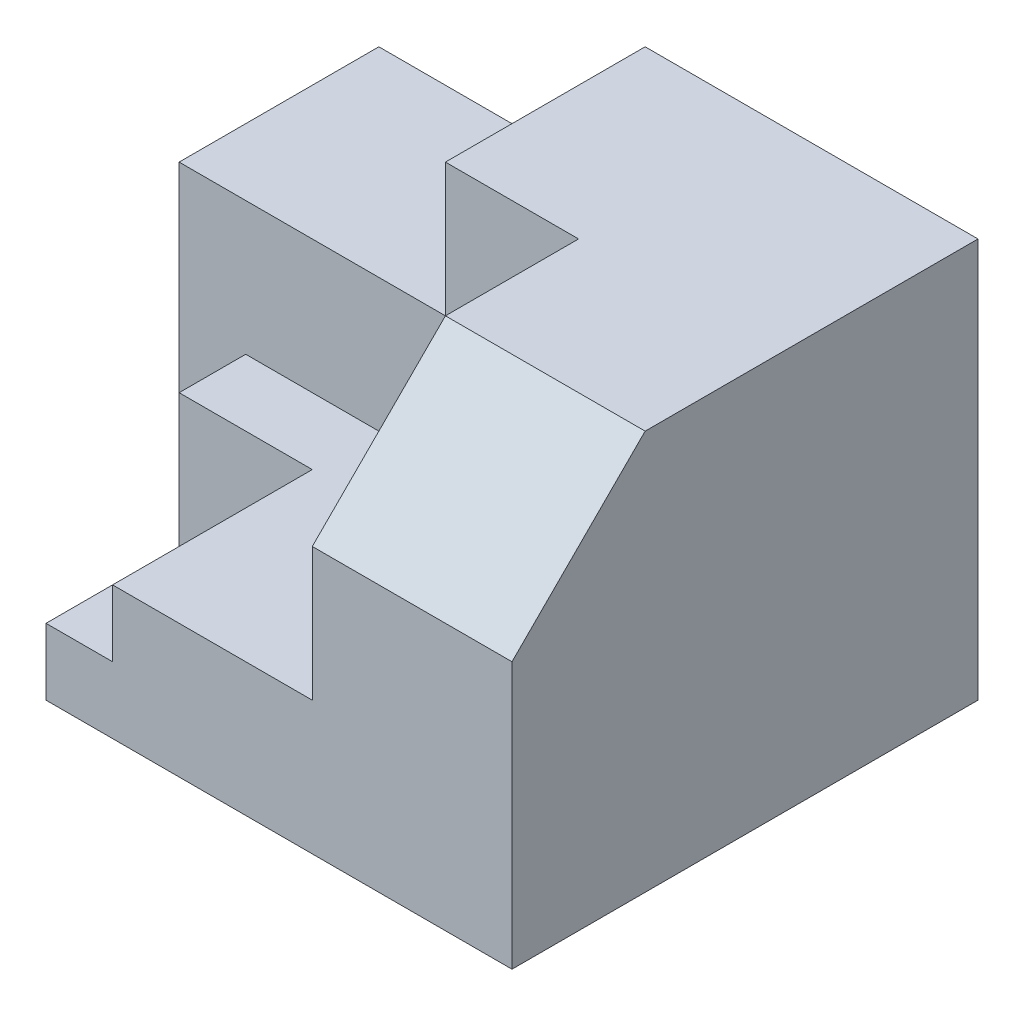
ISO-10303-21;
HEADER;
FILE_DESCRIPTION(('STEP AP214'),'2;1');
FILE_NAME('part.step','',(''),(''),'','','');
FILE_SCHEMA(('AUTOMOTIVE_DESIGN { 1 0 10303 214 1 1 1 1 }'));
ENDSEC;
DATA;
#1=APPLICATION_CONTEXT('core data for automotive mechanical design processes');
#2=APPLICATION_PROTOCOL_DEFINITION('international standard','automotive_design',2000,#1);
#3=PRODUCT_CONTEXT('',#1,'mechanical');
#4=PRODUCT('Part','Part','',(#3));
#5=PRODUCT_RELATED_PRODUCT_CATEGORY('part','',(#4));
#6=PRODUCT_DEFINITION_FORMATION('','',#4);
#7=PRODUCT_DEFINITION_CONTEXT('part definition',#1,'design');
#8=PRODUCT_DEFINITION('design','',#6,#7);
#9=PRODUCT_DEFINITION_SHAPE('','',#8);
#10=(LENGTH_UNIT() NAMED_UNIT(*) SI_UNIT(.MILLI.,.METRE.));
#11=(NAMED_UNIT(*) PLANE_ANGLE_UNIT() SI_UNIT($,.RADIAN.));
#12=(NAMED_UNIT(*) SI_UNIT($,.STERADIAN.) SOLID_ANGLE_UNIT());
#13=UNCERTAINTY_MEASURE_WITH_UNIT(LENGTH_MEASURE(1.E-05),#10,'distance_accuracy_value','');
#14=(GEOMETRIC_REPRESENTATION_CONTEXT(3) GLOBAL_UNCERTAINTY_ASSIGNED_CONTEXT((#13)) GLOBAL_UNIT_ASSIGNED_CONTEXT((#10,
#11,#12)) REPRESENTATION_CONTEXT('',''));
#15=CARTESIAN_POINT('',(0.,0.,0.));
#16=DIRECTION('',(0.,0.,1.));
#17=DIRECTION('',(1.,0.,0.));
#18=AXIS2_PLACEMENT_3D('',#15,#16,#17);
#19=CARTESIAN_POINT('',(0.,20.,0.));
#20=DIRECTION('',(0.,-1.,0.));
#21=DIRECTION('',(0.,0.,-1.));
#22=AXIS2_PLACEMENT_3D('',#19,#20,#21);
#23=PLANE('',#22);
#24=DIRECTION('',(0.,0.,-1.));
#25=VECTOR('',#24,1.);
#26=CARTESIAN_POINT('',(10.,20.,-30.));
#27=LINE('',#26,#25);
#28=CARTESIAN_POINT('',(10.,20.,-30.));
#29=VERTEX_POINT('',#28);
#30=CARTESIAN_POINT('',(10.,20.,-40.));
#31=VERTEX_POINT('',#30);
#32=EDGE_CURVE('E170',#29,#31,#27,.T.);
#33=ORIENTED_EDGE('',*,*,#32,.F.);
#34=DIRECTION('',(-1.,0.,0.));
#35=VECTOR('',#34,1.);
#36=CARTESIAN_POINT('',(0.,20.,-30.));
#37=LINE('',#36,#35);
#38=CARTESIAN_POINT('',(30.,20.,-30.));
#39=VERTEX_POINT('',#38);
#40=EDGE_CURVE('E198',#39,#29,#37,.T.);
#41=ORIENTED_EDGE('',*,*,#40,.F.);
#42=DIRECTION('',(0.,0.,-1.));
#43=VECTOR('',#42,1.);
#44=CARTESIAN_POINT('',(30.,20.,0.));
#45=LINE('',#44,#43);
#46=CARTESIAN_POINT('',(30.,20.,0.));
#47=VERTEX_POINT('',#46);
#48=EDGE_CURVE('E194',#47,#39,#45,.T.);
#49=ORIENTED_EDGE('',*,*,#48,.F.);
#50=DIRECTION('',(1.,0.,0.));
#51=VECTOR('',#50,1.);
#52=CARTESIAN_POINT('',(0.,20.,0.));
#53=LINE('',#52,#51);
#54=CARTESIAN_POINT('',(60.,20.,0.));
#55=VERTEX_POINT('',#54);
#56=EDGE_CURVE('E213',#47,#55,#53,.T.);
#57=ORIENTED_EDGE('',*,*,#56,.T.);
#58=DIRECTION('',(0.,0.,-1.));
#59=VECTOR('',#58,1.);
#60=CARTESIAN_POINT('',(60.,20.,0.));
#61=LINE('',#60,#59);
#62=CARTESIAN_POINT('',(60.,20.,-40.));
#63=VERTEX_POINT('',#62);
#64=EDGE_CURVE('E215',#55,#63,#61,.T.);
#65=ORIENTED_EDGE('',*,*,#64,.T.);
#66=DIRECTION('',(-1.,0.,0.));
#67=VECTOR('',#66,1.);
#68=CARTESIAN_POINT('',(0.,20.,-40.));
#69=LINE('',#68,#67);
#70=EDGE_CURVE('E218',#63,#31,#69,.T.);
#71=ORIENTED_EDGE('',*,*,#70,.T.);
#72=EDGE_LOOP('',(#33,#41,#49,#57,#65,#71));
#73=FACE_BOUND('',#72,.T.);
#74=ADVANCED_FACE('F33',(#73),#23,.F.);
#75=CARTESIAN_POINT('',(0.,10.,-30.));
#76=DIRECTION('',(0.,0.,-1.));
#77=DIRECTION('',(-1.,0.,0.));
#78=AXIS2_PLACEMENT_3D('',#75,#76,#77);
#79=PLANE('',#78);
#80=DIRECTION('',(0.,1.,0.));
#81=VECTOR('',#80,1.);
#82=CARTESIAN_POINT('',(10.,0.,-30.));
#83=LINE('',#82,#81);
#84=CARTESIAN_POINT('',(10.,0.,-30.));
#85=VERTEX_POINT('',#84);
#86=EDGE_CURVE('E164',#85,#29,#83,.T.);
#87=ORIENTED_EDGE('',*,*,#86,.F.);
#88=DIRECTION('',(-1.,0.,0.));
#89=VECTOR('',#88,1.);
#90=CARTESIAN_POINT('',(20.,0.,-30.));
#91=LINE('',#90,#89);
#92=CARTESIAN_POINT('',(20.,0.,-30.));
#93=VERTEX_POINT('',#92);
#94=EDGE_CURVE('E191',#93,#85,#91,.T.);
#95=ORIENTED_EDGE('',*,*,#94,.F.);
#96=DIRECTION('',(0.,-1.,0.));
#97=VECTOR('',#96,1.);
#98=CARTESIAN_POINT('',(20.,0.,-30.));
#99=LINE('',#98,#97);
#100=CARTESIAN_POINT('',(20.,10.,-30.));
#101=VERTEX_POINT('',#100);
#102=EDGE_CURVE('E186',#101,#93,#99,.T.);
#103=ORIENTED_EDGE('',*,*,#102,.F.);
#104=DIRECTION('',(-1.,0.,0.));
#105=VECTOR('',#104,1.);
#106=CARTESIAN_POINT('',(0.,10.,-30.));
#107=LINE('',#106,#105);
#108=CARTESIAN_POINT('',(30.,10.,-30.));
#109=VERTEX_POINT('',#108);
#110=EDGE_CURVE('E201',#109,#101,#107,.T.);
#111=ORIENTED_EDGE('',*,*,#110,.F.);
#112=DIRECTION('',(0.,1.,0.));
#113=VECTOR('',#112,1.);
#114=CARTESIAN_POINT('',(30.,10.,-30.));
#115=LINE('',#114,#113);
#116=EDGE_CURVE('E209',#109,#39,#115,.T.);
#117=ORIENTED_EDGE('',*,*,#116,.T.);
#118=ORIENTED_EDGE('',*,*,#40,.T.);
#119=EDGE_LOOP('',(#87,#95,#103,#111,#117,#118));
#120=FACE_BOUND('',#119,.T.);
#121=ADVANCED_FACE('F283',(#120),#79,.F.);
#122=CARTESIAN_POINT('',(0.,60.,0.));
#123=DIRECTION('',(0.,0.,-1.));
#124=DIRECTION('',(-1.,0.,0.));
#125=AXIS2_PLACEMENT_3D('',#122,#123,#124);
#126=PLANE('',#125);
#127=DIRECTION('',(0.,-1.,0.));
#128=VECTOR('',#127,1.);
#129=CARTESIAN_POINT('',(90.,60.,0.));
#130=LINE('',#129,#128);
#131=CARTESIAN_POINT('',(90.,39.9999999999999,0.));
#132=VERTEX_POINT('',#131);
#133=CARTESIAN_POINT('',(90.,0.,0.));
#134=VERTEX_POINT('',#133);
#135=EDGE_CURVE('E250',#132,#134,#130,.T.);
#136=ORIENTED_EDGE('',*,*,#135,.F.);
#137=DIRECTION('',(-1.,0.,0.));
#138=VECTOR('',#137,1.);
#139=CARTESIAN_POINT('',(0.,39.9999999999999,0.));
#140=LINE('',#139,#138);
#141=CARTESIAN_POINT('',(60.,39.9999999999999,0.));
#142=VERTEX_POINT('',#141);
#143=EDGE_CURVE('E41',#132,#142,#140,.T.);
#144=ORIENTED_EDGE('',*,*,#143,.T.);
#145=DIRECTION('',(0.,1.,0.));
#146=VECTOR('',#145,1.);
#147=CARTESIAN_POINT('',(60.,20.,0.));
#148=LINE('',#147,#146);
#149=EDGE_CURVE('E221',#55,#142,#148,.T.);
#150=ORIENTED_EDGE('',*,*,#149,.F.);
#151=ORIENTED_EDGE('',*,*,#56,.F.);
#152=DIRECTION('',(0.,1.,0.));
#153=VECTOR('',#152,1.);
#154=CARTESIAN_POINT('',(30.,10.,0.));
#155=LINE('',#154,#153);
#156=CARTESIAN_POINT('',(30.,10.,0.));
#157=VERTEX_POINT('',#156);
#158=EDGE_CURVE('E204',#157,#47,#155,.T.);
#159=ORIENTED_EDGE('',*,*,#158,.F.);
#160=DIRECTION('',(1.,0.,0.));
#161=VECTOR('',#160,1.);
#162=CARTESIAN_POINT('',(0.,10.,0.));
#163=LINE('',#162,#161);
#164=CARTESIAN_POINT('',(20.,10.,0.));
#165=VERTEX_POINT('',#164);
#166=EDGE_CURVE('E195',#165,#157,#163,.T.);
#167=ORIENTED_EDGE('',*,*,#166,.F.);
#168=DIRECTION('',(0.,1.,0.));
#169=VECTOR('',#168,1.);
#170=CARTESIAN_POINT('',(20.,0.,0.));
#171=LINE('',#170,#169);
#172=CARTESIAN_POINT('',(20.,0.,0.));
#173=VERTEX_POINT('',#172);
#174=EDGE_CURVE('E181',#173,#165,#171,.T.);
#175=ORIENTED_EDGE('',*,*,#174,.F.);
#176=DIRECTION('',(1.,0.,0.));
#177=VECTOR('',#176,1.);
#178=CARTESIAN_POINT('',(0.,0.,0.));
#179=LINE('',#178,#177);
#180=EDGE_CURVE('E239',#173,#134,#179,.T.);
#181=ORIENTED_EDGE('',*,*,#180,.T.);
#182=EDGE_LOOP('',(#136,#144,#150,#151,#159,#167,#175,#181));
#183=FACE_BOUND('',#182,.T.);
#184=ADVANCED_FACE('F303',(#183),#126,.F.);
#185=CARTESIAN_POINT('',(0.,10.,0.));
#186=DIRECTION('',(0.,-1.,0.));
#187=DIRECTION('',(0.,0.,-1.));
#188=AXIS2_PLACEMENT_3D('',#185,#186,#187);
#189=PLANE('',#188);
#190=DIRECTION('',(0.,0.,-1.));
#191=VECTOR('',#190,1.);
#192=CARTESIAN_POINT('',(20.,10.,0.));
#193=LINE('',#192,#191);
#194=EDGE_CURVE('E183',#165,#101,#193,.T.);
#195=ORIENTED_EDGE('',*,*,#194,.F.);
#196=ORIENTED_EDGE('',*,*,#166,.T.);
#197=DIRECTION('',(0.,0.,-1.));
#198=VECTOR('',#197,1.);
#199=CARTESIAN_POINT('',(30.,10.,0.));
#200=LINE('',#199,#198);
#201=EDGE_CURVE('E197',#157,#109,#200,.T.);
#202=ORIENTED_EDGE('',*,*,#201,.T.);
#203=ORIENTED_EDGE('',*,*,#110,.T.);
#204=EDGE_LOOP('',(#195,#196,#202,#203));
#205=FACE_BOUND('',#204,.T.);
#206=ADVANCED_FACE('F321',(#205),#189,.F.);
#207=CARTESIAN_POINT('',(0.,60.,0.));
#208=DIRECTION('',(1.,0.,0.));
#209=DIRECTION('',(0.,0.,-1.));
#210=AXIS2_PLACEMENT_3D('',#207,#208,#209);
#211=PLANE('',#210);
#212=DIRECTION('',(0.,1.,0.));
#213=VECTOR('',#212,1.);
#214=CARTESIAN_POINT('',(0.,20.,-40.));
#215=LINE('',#214,#213);
#216=CARTESIAN_POINT('',(0.,0.,-40.));
#217=VERTEX_POINT('',#216);
#218=CARTESIAN_POINT('',(0.,40.,-40.));
#219=VERTEX_POINT('',#218);
#220=EDGE_CURVE('E224',#217,#219,#215,.T.);
#221=ORIENTED_EDGE('',*,*,#220,.T.);
#222=DIRECTION('',(0.,0.,1.));
#223=VECTOR('',#222,1.);
#224=CARTESIAN_POINT('',(0.,40.,-40.));
#225=LINE('',#224,#223);
#226=CARTESIAN_POINT('',(0.,40.,-70.));
#227=VERTEX_POINT('',#226);
#228=EDGE_CURVE('E154',#227,#219,#225,.T.);
#229=ORIENTED_EDGE('',*,*,#228,.F.);
#230=DIRECTION('',(0.,-1.,0.));
#231=VECTOR('',#230,1.);
#232=CARTESIAN_POINT('',(0.,60.,-70.));
#233=LINE('',#232,#231);
#234=CARTESIAN_POINT('',(0.,0.,-70.));
#235=VERTEX_POINT('',#234);
#236=EDGE_CURVE('E236',#227,#235,#233,.T.);
#237=ORIENTED_EDGE('',*,*,#236,.T.);
#238=DIRECTION('',(0.,0.,1.));
#239=VECTOR('',#238,1.);
#240=CARTESIAN_POINT('',(0.,0.,0.));
#241=LINE('',#240,#239);
#242=EDGE_CURVE('E226',#235,#217,#241,.T.);
#243=ORIENTED_EDGE('',*,*,#242,.T.);
#244=EDGE_LOOP('',(#221,#229,#237,#243));
#245=FACE_BOUND('',#244,.T.);
#246=ADVANCED_FACE('F272',(#245),#211,.F.);
#247=CARTESIAN_POINT('',(90.,60.,0.));
#248=DIRECTION('',(-1.,0.,0.));
#249=DIRECTION('',(0.,0.,1.));
#250=AXIS2_PLACEMENT_3D('',#247,#248,#249);
#251=PLANE('',#250);
#252=DIRECTION('',(0.,0.,-1.));
#253=VECTOR('',#252,1.);
#254=CARTESIAN_POINT('',(90.,60.,0.));
#255=LINE('',#254,#253);
#256=CARTESIAN_POINT('',(90.,60.,-20.0000000000001));
#257=VERTEX_POINT('',#256);
#258=CARTESIAN_POINT('',(90.,60.,-70.));
#259=VERTEX_POINT('',#258);
#260=EDGE_CURVE('E230',#257,#259,#255,.T.);
#261=ORIENTED_EDGE('',*,*,#260,.F.);
#262=DIRECTION('',(0.,0.707106781186548,-0.707106781186547));
#263=VECTOR('',#262,1.);
#264=CARTESIAN_POINT('',(90.,60.,-20.0000000000001));
#265=LINE('',#264,#263);
#266=EDGE_CURVE('E55',#257,#132,#265,.F.);
#267=ORIENTED_EDGE('',*,*,#266,.T.);
#268=ORIENTED_EDGE('',*,*,#135,.T.);
#269=DIRECTION('',(0.,0.,-1.));
#270=VECTOR('',#269,1.);
#271=CARTESIAN_POINT('',(90.,0.,0.));
#272=LINE('',#271,#270);
#273=CARTESIAN_POINT('',(90.,0.,-70.));
#274=VERTEX_POINT('',#273);
#275=EDGE_CURVE('E242',#134,#274,#272,.T.);
#276=ORIENTED_EDGE('',*,*,#275,.T.);
#277=DIRECTION('',(0.,-1.,0.));
#278=VECTOR('',#277,1.);
#279=CARTESIAN_POINT('',(90.,60.,-70.));
#280=LINE('',#279,#278);
#281=EDGE_CURVE('E247',#259,#274,#280,.T.);
#282=ORIENTED_EDGE('',*,*,#281,.F.);
#283=EDGE_LOOP('',(#261,#267,#268,#276,#282));
#284=FACE_BOUND('',#283,.T.);
#285=ADVANCED_FACE('F262',(#284),#251,.F.);
#286=CARTESIAN_POINT('',(0.,60.,-70.));
#287=DIRECTION('',(0.,0.,1.));
#288=DIRECTION('',(1.,0.,0.));
#289=AXIS2_PLACEMENT_3D('',#286,#287,#288);
#290=PLANE('',#289);
#291=DIRECTION('',(-1.,0.,0.));
#292=VECTOR('',#291,1.);
#293=CARTESIAN_POINT('',(0.,40.,-70.));
#294=LINE('',#293,#292);
#295=CARTESIAN_POINT('',(40.,40.,-70.));
#296=VERTEX_POINT('',#295);
#297=EDGE_CURVE('E148',#296,#227,#294,.T.);
#298=ORIENTED_EDGE('',*,*,#297,.F.);
#299=DIRECTION('',(0.,1.,0.));
#300=VECTOR('',#299,1.);
#301=CARTESIAN_POINT('',(40.,40.,-70.));
#302=LINE('',#301,#300);
#303=CARTESIAN_POINT('',(40.,60.,-70.));
#304=VERTEX_POINT('',#303);
#305=EDGE_CURVE('E145',#296,#304,#302,.T.);
#306=ORIENTED_EDGE('',*,*,#305,.T.);
#307=DIRECTION('',(-1.,0.,0.));
#308=VECTOR('',#307,1.);
#309=CARTESIAN_POINT('',(0.,60.,-70.));
#310=LINE('',#309,#308);
#311=EDGE_CURVE('E232',#259,#304,#310,.T.);
#312=ORIENTED_EDGE('',*,*,#311,.F.);
#313=ORIENTED_EDGE('',*,*,#281,.T.);
#314=DIRECTION('',(-1.,0.,0.));
#315=VECTOR('',#314,1.);
#316=CARTESIAN_POINT('',(0.,0.,-70.));
#317=LINE('',#316,#315);
#318=EDGE_CURVE('E233',#274,#235,#317,.T.);
#319=ORIENTED_EDGE('',*,*,#318,.T.);
#320=ORIENTED_EDGE('',*,*,#236,.F.);
#321=EDGE_LOOP('',(#298,#306,#312,#313,#319,#320));
#322=FACE_BOUND('',#321,.T.);
#323=ADVANCED_FACE('F267',(#322),#290,.F.);
#324=CARTESIAN_POINT('',(0.,60.,0.));
#325=DIRECTION('',(0.,-1.,0.));
#326=DIRECTION('',(0.,0.,-1.));
#327=AXIS2_PLACEMENT_3D('',#324,#325,#326);
#328=PLANE('',#327);
#329=DIRECTION('',(0.,0.,-1.));
#330=VECTOR('',#329,1.);
#331=CARTESIAN_POINT('',(60.,60.,0.));
#332=LINE('',#331,#330);
#333=CARTESIAN_POINT('',(60.,60.,-20.0000000000001));
#334=VERTEX_POINT('',#333);
#335=CARTESIAN_POINT('',(60.,60.,-40.));
#336=VERTEX_POINT('',#335);
#337=EDGE_CURVE('E211',#334,#336,#332,.T.);
#338=ORIENTED_EDGE('',*,*,#337,.F.);
#339=DIRECTION('',(1.,0.,0.));
#340=VECTOR('',#339,1.);
#341=CARTESIAN_POINT('',(0.,60.,-20.0000000000001));
#342=LINE('',#341,#340);
#343=EDGE_CURVE('E252',#334,#257,#342,.T.);
#344=ORIENTED_EDGE('',*,*,#343,.T.);
#345=ORIENTED_EDGE('',*,*,#260,.T.);
#346=ORIENTED_EDGE('',*,*,#311,.T.);
#347=DIRECTION('',(0.,0.,-1.));
#348=VECTOR('',#347,1.);
#349=CARTESIAN_POINT('',(40.,60.,-40.));
#350=LINE('',#349,#348);
#351=CARTESIAN_POINT('',(40.,60.,-40.));
#352=VERTEX_POINT('',#351);
#353=EDGE_CURVE('E268',#352,#304,#350,.T.);
#354=ORIENTED_EDGE('',*,*,#353,.F.);
#355=DIRECTION('',(-1.,0.,0.));
#356=VECTOR('',#355,1.);
#357=CARTESIAN_POINT('',(0.,60.,-40.));
#358=LINE('',#357,#356);
#359=EDGE_CURVE('E162',#336,#352,#358,.T.);
#360=ORIENTED_EDGE('',*,*,#359,.F.);
#361=EDGE_LOOP('',(#338,#344,#345,#346,#354,#360));
#362=FACE_BOUND('',#361,.T.);
#363=ADVANCED_FACE('F258',(#362),#328,.F.);
#364=CARTESIAN_POINT('',(0.,0.,0.));
#365=DIRECTION('',(0.,-1.,0.));
#366=DIRECTION('',(0.,0.,-1.));
#367=AXIS2_PLACEMENT_3D('',#364,#365,#366);
#368=PLANE('',#367);
#369=DIRECTION('',(-1.,0.,0.));
#370=VECTOR('',#369,1.);
#371=CARTESIAN_POINT('',(10.,0.,-40.));
#372=LINE('',#371,#370);
#373=CARTESIAN_POINT('',(10.,0.,-40.));
#374=VERTEX_POINT('',#373);
#375=EDGE_CURVE('E178',#374,#217,#372,.T.);
#376=ORIENTED_EDGE('',*,*,#375,.T.);
#377=ORIENTED_EDGE('',*,*,#242,.F.);
#378=ORIENTED_EDGE('',*,*,#318,.F.);
#379=ORIENTED_EDGE('',*,*,#275,.F.);
#380=ORIENTED_EDGE('',*,*,#180,.F.);
#381=DIRECTION('',(0.,0.,1.));
#382=VECTOR('',#381,1.);
#383=CARTESIAN_POINT('',(20.,0.,0.));
#384=LINE('',#383,#382);
#385=EDGE_CURVE('E189',#93,#173,#384,.T.);
#386=ORIENTED_EDGE('',*,*,#385,.F.);
#387=ORIENTED_EDGE('',*,*,#94,.T.);
#388=DIRECTION('',(0.,0.,1.));
#389=VECTOR('',#388,1.);
#390=CARTESIAN_POINT('',(10.,0.,-30.));
#391=LINE('',#390,#389);
#392=EDGE_CURVE('E176',#374,#85,#391,.T.);
#393=ORIENTED_EDGE('',*,*,#392,.F.);
#394=EDGE_LOOP('',(#376,#377,#378,#379,#380,#386,#387,#393));
#395=FACE_BOUND('',#394,.T.);
#396=ADVANCED_FACE('F276',(#395),#368,.T.);
#397=CARTESIAN_POINT('',(0.,20.,-40.));
#398=DIRECTION('',(0.,0.,-1.));
#399=DIRECTION('',(-1.,0.,0.));
#400=AXIS2_PLACEMENT_3D('',#397,#398,#399);
#401=PLANE('',#400);
#402=ORIENTED_EDGE('',*,*,#359,.T.);
#403=DIRECTION('',(0.,1.,0.));
#404=VECTOR('',#403,1.);
#405=CARTESIAN_POINT('',(40.,40.,-40.));
#406=LINE('',#405,#404);
#407=CARTESIAN_POINT('',(40.,40.,-40.));
#408=VERTEX_POINT('',#407);
#409=EDGE_CURVE('E142',#408,#352,#406,.T.);
#410=ORIENTED_EDGE('',*,*,#409,.F.);
#411=DIRECTION('',(1.,0.,0.));
#412=VECTOR('',#411,1.);
#413=CARTESIAN_POINT('',(0.,40.,-40.));
#414=LINE('',#413,#412);
#415=EDGE_CURVE('E149',#219,#408,#414,.T.);
#416=ORIENTED_EDGE('',*,*,#415,.F.);
#417=ORIENTED_EDGE('',*,*,#220,.F.);
#418=ORIENTED_EDGE('',*,*,#375,.F.);
#419=DIRECTION('',(0.,-1.,0.));
#420=VECTOR('',#419,1.);
#421=CARTESIAN_POINT('',(10.,0.,-40.));
#422=LINE('',#421,#420);
#423=EDGE_CURVE('E173',#31,#374,#422,.T.);
#424=ORIENTED_EDGE('',*,*,#423,.F.);
#425=ORIENTED_EDGE('',*,*,#70,.F.);
#426=DIRECTION('',(0.,1.,0.));
#427=VECTOR('',#426,1.);
#428=CARTESIAN_POINT('',(60.,20.,-40.));
#429=LINE('',#428,#427);
#430=EDGE_CURVE('E227',#63,#336,#429,.T.);
#431=ORIENTED_EDGE('',*,*,#430,.T.);
#432=EDGE_LOOP('',(#402,#410,#416,#417,#418,#424,#425,#431));
#433=FACE_BOUND('',#432,.T.);
#434=ADVANCED_FACE('F159',(#433),#401,.F.);
#435=CARTESIAN_POINT('',(60.,20.,0.));
#436=DIRECTION('',(1.,0.,0.));
#437=DIRECTION('',(0.,0.,-1.));
#438=AXIS2_PLACEMENT_3D('',#435,#436,#437);
#439=PLANE('',#438);
#440=ORIENTED_EDGE('',*,*,#149,.T.);
#441=DIRECTION('',(0.,-0.707106781186548,0.707106781186547));
#442=VECTOR('',#441,1.);
#443=CARTESIAN_POINT('',(60.,60.,-20.0000000000001));
#444=LINE('',#443,#442);
#445=EDGE_CURVE('E11',#142,#334,#444,.F.);
#446=ORIENTED_EDGE('',*,*,#445,.T.);
#447=ORIENTED_EDGE('',*,*,#337,.T.);
#448=ORIENTED_EDGE('',*,*,#430,.F.);
#449=ORIENTED_EDGE('',*,*,#64,.F.);
#450=EDGE_LOOP('',(#440,#446,#447,#448,#449));
#451=FACE_BOUND('',#450,.T.);
#452=ADVANCED_FACE('F292',(#451),#439,.F.);
#453=CARTESIAN_POINT('',(30.,10.,0.));
#454=DIRECTION('',(1.,0.,0.));
#455=DIRECTION('',(0.,0.,-1.));
#456=AXIS2_PLACEMENT_3D('',#453,#454,#455);
#457=PLANE('',#456);
#458=ORIENTED_EDGE('',*,*,#48,.T.);
#459=ORIENTED_EDGE('',*,*,#116,.F.);
#460=ORIENTED_EDGE('',*,*,#201,.F.);
#461=ORIENTED_EDGE('',*,*,#158,.T.);
#462=EDGE_LOOP('',(#458,#459,#460,#461));
#463=FACE_BOUND('',#462,.T.);
#464=ADVANCED_FACE('F307',(#463),#457,.F.);
#465=CARTESIAN_POINT('',(20.,0.,0.));
#466=DIRECTION('',(-1.,0.,0.));
#467=DIRECTION('',(0.,0.,1.));
#468=AXIS2_PLACEMENT_3D('',#465,#466,#467);
#469=PLANE('',#468);
#470=ORIENTED_EDGE('',*,*,#174,.T.);
#471=ORIENTED_EDGE('',*,*,#194,.T.);
#472=ORIENTED_EDGE('',*,*,#102,.T.);
#473=ORIENTED_EDGE('',*,*,#385,.T.);
#474=EDGE_LOOP('',(#470,#471,#472,#473));
#475=FACE_BOUND('',#474,.T.);
#476=ADVANCED_FACE('F332',(#475),#469,.T.);
#477=CARTESIAN_POINT('',(10.,0.,0.));
#478=DIRECTION('',(-1.,0.,0.));
#479=DIRECTION('',(0.,0.,1.));
#480=AXIS2_PLACEMENT_3D('',#477,#478,#479);
#481=PLANE('',#480);
#482=ORIENTED_EDGE('',*,*,#86,.T.);
#483=ORIENTED_EDGE('',*,*,#32,.T.);
#484=ORIENTED_EDGE('',*,*,#423,.T.);
#485=ORIENTED_EDGE('',*,*,#392,.T.);
#486=EDGE_LOOP('',(#482,#483,#484,#485));
#487=FACE_BOUND('',#486,.T.);
#488=ADVANCED_FACE('F280',(#487),#481,.T.);
#489=CARTESIAN_POINT('',(40.,40.,-40.));
#490=DIRECTION('',(1.,0.,0.));
#491=DIRECTION('',(0.,0.,-1.));
#492=AXIS2_PLACEMENT_3D('',#489,#490,#491);
#493=PLANE('',#492);
#494=ORIENTED_EDGE('',*,*,#353,.T.);
#495=ORIENTED_EDGE('',*,*,#305,.F.);
#496=DIRECTION('',(0.,0.,-1.));
#497=VECTOR('',#496,1.);
#498=CARTESIAN_POINT('',(40.,40.,-40.));
#499=LINE('',#498,#497);
#500=EDGE_CURVE('E138',#408,#296,#499,.T.);
#501=ORIENTED_EDGE('',*,*,#500,.F.);
#502=ORIENTED_EDGE('',*,*,#409,.T.);
#503=EDGE_LOOP('',(#494,#495,#501,#502));
#504=FACE_BOUND('',#503,.T.);
#505=ADVANCED_FACE('F140',(#504),#493,.F.);
#506=CARTESIAN_POINT('',(0.,40.,0.));
#507=DIRECTION('',(0.,-1.,0.));
#508=DIRECTION('',(0.,0.,-1.));
#509=AXIS2_PLACEMENT_3D('',#506,#507,#508);
#510=PLANE('',#509);
#511=ORIENTED_EDGE('',*,*,#228,.T.);
#512=ORIENTED_EDGE('',*,*,#415,.T.);
#513=ORIENTED_EDGE('',*,*,#500,.T.);
#514=ORIENTED_EDGE('',*,*,#297,.T.);
#515=EDGE_LOOP('',(#511,#512,#513,#514));
#516=FACE_BOUND('',#515,.T.);
#517=ADVANCED_FACE('F152',(#516),#510,.F.);
#518=CARTESIAN_POINT('',(0.,60.,-20.0000000000001));
#519=DIRECTION('',(0.,-0.707106781186547,-0.707106781186548));
#520=DIRECTION('',(1.,0.,0.));
#521=AXIS2_PLACEMENT_3D('',#518,#519,#520);
#522=PLANE('',#521);
#523=ORIENTED_EDGE('',*,*,#445,.F.);
#524=ORIENTED_EDGE('',*,*,#143,.F.);
#525=ORIENTED_EDGE('',*,*,#266,.F.);
#526=ORIENTED_EDGE('',*,*,#343,.F.);
#527=EDGE_LOOP('',(#523,#524,#525,#526));
#528=FACE_BOUND('',#527,.T.);
#529=ADVANCED_FACE('F35',(#528),#522,.F.);
#530=CLOSED_SHELL('',(#74,#121,#184,#206,#246,#285,#323,#363,#396,#434,#452,#464,#476,#488,#505,
#517,#529));
#531=MANIFOLD_SOLID_BREP('B2',#530);
#532=ADVANCED_BREP_SHAPE_REPRESENTATION('',(#18,#531),#14);
#533=SHAPE_DEFINITION_REPRESENTATION(#9,#532);
ENDSEC;
END-ISO-10303-21;
